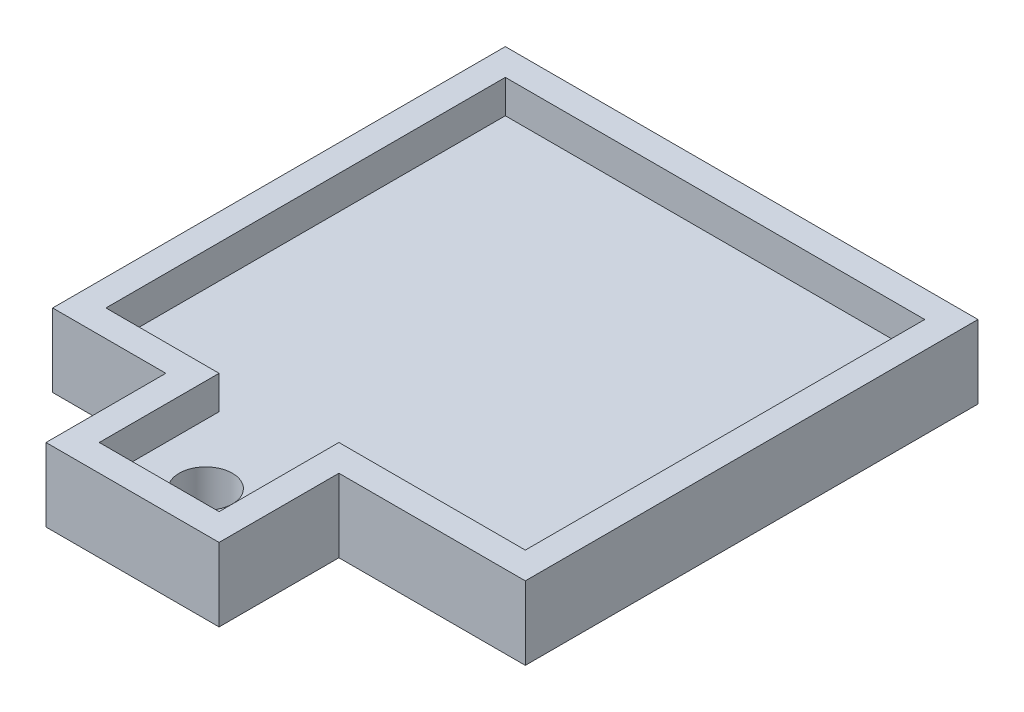
ISO-10303-21;
HEADER;
FILE_DESCRIPTION(('STEP AP214'),'2;1');
FILE_NAME('part.step','',(''),(''),'','','');
FILE_SCHEMA(('AUTOMOTIVE_DESIGN { 1 0 10303 214 1 1 1 1 }'));
ENDSEC;
DATA;
#1=APPLICATION_CONTEXT('core data for automotive mechanical design processes');
#2=APPLICATION_PROTOCOL_DEFINITION('international standard','automotive_design',2000,#1);
#3=PRODUCT_CONTEXT('',#1,'mechanical');
#4=PRODUCT('Part','Part','',(#3));
#5=PRODUCT_RELATED_PRODUCT_CATEGORY('part','',(#4));
#6=PRODUCT_DEFINITION_FORMATION('','',#4);
#7=PRODUCT_DEFINITION_CONTEXT('part definition',#1,'design');
#8=PRODUCT_DEFINITION('design','',#6,#7);
#9=PRODUCT_DEFINITION_SHAPE('','',#8);
#10=(LENGTH_UNIT() NAMED_UNIT(*) SI_UNIT(.MILLI.,.METRE.));
#11=(NAMED_UNIT(*) PLANE_ANGLE_UNIT() SI_UNIT($,.RADIAN.));
#12=(NAMED_UNIT(*) SI_UNIT($,.STERADIAN.) SOLID_ANGLE_UNIT());
#13=UNCERTAINTY_MEASURE_WITH_UNIT(LENGTH_MEASURE(1.E-05),#10,'distance_accuracy_value','');
#14=(GEOMETRIC_REPRESENTATION_CONTEXT(3) GLOBAL_UNCERTAINTY_ASSIGNED_CONTEXT((#13)) GLOBAL_UNIT_ASSIGNED_CONTEXT((#10,
#11,#12)) REPRESENTATION_CONTEXT('',''));
#15=CARTESIAN_POINT('',(0.,0.,0.));
#16=DIRECTION('',(0.,0.,1.));
#17=DIRECTION('',(1.,0.,0.));
#18=AXIS2_PLACEMENT_3D('',#15,#16,#17);
#19=CARTESIAN_POINT('',(-4.42128095830151,16.5,-117.760696826429));
#20=DIRECTION('',(0.,-1.,0.));
#21=DIRECTION('',(0.,0.,-1.));
#22=AXIS2_PLACEMENT_3D('',#19,#20,#21);
#23=CYLINDRICAL_SURFACE('',#22,2.);
#24=CARTESIAN_POINT('',(-4.42128095830151,16.5,-117.760696826429));
#25=DIRECTION('',(0.,1.,0.));
#26=DIRECTION('',(0.,0.,1.));
#27=AXIS2_PLACEMENT_3D('',#24,#25,#26);
#28=CIRCLE('',#27,2.);
#29=CARTESIAN_POINT('',(-4.42128095830151,16.5,-115.760696826429));
#30=VERTEX_POINT('',#29);
#31=EDGE_CURVE('E268',#30,#30,#28,.T.);
#32=ORIENTED_EDGE('',*,*,#31,.T.);
#33=EDGE_LOOP('',(#32));
#34=FACE_BOUND('',#33,.T.);
#35=CARTESIAN_POINT('',(-4.42128095830151,13.5,-117.760696826429));
#36=DIRECTION('',(0.,1.,0.));
#37=DIRECTION('',(0.,0.,1.));
#38=AXIS2_PLACEMENT_3D('',#35,#36,#37);
#39=CIRCLE('',#38,2.);
#40=CARTESIAN_POINT('',(-4.42128095830151,13.5,-115.760696826429));
#41=VERTEX_POINT('',#40);
#42=EDGE_CURVE('E39',#41,#41,#39,.T.);
#43=ORIENTED_EDGE('',*,*,#42,.F.);
#44=EDGE_LOOP('',(#43));
#45=FACE_BOUND('',#44,.T.);
#46=ADVANCED_FACE('F36',(#34,#45),#23,.F.);
#47=CARTESIAN_POINT('',(-1.67128095830151,16.5,-123.260696826429));
#48=DIRECTION('',(0.,1.,0.));
#49=DIRECTION('',(0.,0.,1.));
#50=AXIS2_PLACEMENT_3D('',#47,#48,#49);
#51=PLANE('',#50);
#52=ORIENTED_EDGE('',*,*,#31,.F.);
#53=EDGE_LOOP('',(#52));
#54=FACE_BOUND('',#53,.T.);
#55=DIRECTION('',(0.,0.,-1.));
#56=VECTOR('',#55,1.);
#57=CARTESIAN_POINT('',(0.0787190416984923,16.5,-123.260696826429));
#58=LINE('',#57,#56);
#59=CARTESIAN_POINT('',(0.0787190416984923,16.5,-114.260696826429));
#60=VERTEX_POINT('',#59);
#61=CARTESIAN_POINT('',(0.0787190416984923,16.5,-123.260696826429));
#62=VERTEX_POINT('',#61);
#63=EDGE_CURVE('E271',#60,#62,#58,.T.);
#64=ORIENTED_EDGE('',*,*,#63,.T.);
#65=DIRECTION('',(1.,0.,0.));
#66=VECTOR('',#65,1.);
#67=CARTESIAN_POINT('',(-1.67128095830151,16.5,-123.260696826429));
#68=LINE('',#67,#66);
#69=CARTESIAN_POINT('',(14.0787190416985,16.5,-123.260696826429));
#70=VERTEX_POINT('',#69);
#71=EDGE_CURVE('E273',#62,#70,#68,.T.);
#72=ORIENTED_EDGE('',*,*,#71,.T.);
#73=DIRECTION('',(0.,0.,1.));
#74=VECTOR('',#73,1.);
#75=CARTESIAN_POINT('',(14.0787190416985,16.5,-123.260696826429));
#76=LINE('',#75,#74);
#77=CARTESIAN_POINT('',(14.0787190416985,16.5,-153.260696826429));
#78=VERTEX_POINT('',#77);
#79=EDGE_CURVE('E275',#78,#70,#76,.T.);
#80=ORIENTED_EDGE('',*,*,#79,.F.);
#81=DIRECTION('',(1.,0.,0.));
#82=VECTOR('',#81,1.);
#83=CARTESIAN_POINT('',(-1.67128095830151,16.5,-153.260696826429));
#84=LINE('',#83,#82);
#85=CARTESIAN_POINT('',(-17.4212809583015,16.5,-153.260696826429));
#86=VERTEX_POINT('',#85);
#87=EDGE_CURVE('E152',#86,#78,#84,.T.);
#88=ORIENTED_EDGE('',*,*,#87,.F.);
#89=DIRECTION('',(0.,0.,1.));
#90=VECTOR('',#89,1.);
#91=CARTESIAN_POINT('',(-17.4212809583015,16.5,-123.260696826429));
#92=LINE('',#91,#90);
#93=CARTESIAN_POINT('',(-17.4212809583015,16.5,-123.260696826429));
#94=VERTEX_POINT('',#93);
#95=EDGE_CURVE('E278',#86,#94,#92,.T.);
#96=ORIENTED_EDGE('',*,*,#95,.T.);
#97=DIRECTION('',(1.,0.,0.));
#98=VECTOR('',#97,1.);
#99=CARTESIAN_POINT('',(-1.67128095830151,16.5,-123.260696826429));
#100=LINE('',#99,#98);
#101=CARTESIAN_POINT('',(-8.92128095830151,16.5,-123.260696826429));
#102=VERTEX_POINT('',#101);
#103=EDGE_CURVE('E280',#94,#102,#100,.T.);
#104=ORIENTED_EDGE('',*,*,#103,.T.);
#105=DIRECTION('',(0.,0.,1.));
#106=VECTOR('',#105,1.);
#107=CARTESIAN_POINT('',(-8.92128095830151,16.5,-123.260696826429));
#108=LINE('',#107,#106);
#109=CARTESIAN_POINT('',(-8.92128095830151,16.5,-114.260696826429));
#110=VERTEX_POINT('',#109);
#111=EDGE_CURVE('E44',#102,#110,#108,.T.);
#112=ORIENTED_EDGE('',*,*,#111,.T.);
#113=DIRECTION('',(1.,0.,0.));
#114=VECTOR('',#113,1.);
#115=CARTESIAN_POINT('',(-1.67128095830151,16.5,-114.260696826429));
#116=LINE('',#115,#114);
#117=EDGE_CURVE('E11',#110,#60,#116,.T.);
#118=ORIENTED_EDGE('',*,*,#117,.T.);
#119=EDGE_LOOP('',(#64,#72,#80,#88,#96,#104,#112,#118));
#120=FACE_BOUND('',#119,.T.);
#121=ADVANCED_FACE('F283',(#54,#120),#51,.T.);
#122=CARTESIAN_POINT('',(-1.67128095830151,13.5,-123.260696826429));
#123=DIRECTION('',(0.,1.,0.));
#124=DIRECTION('',(0.,0.,1.));
#125=AXIS2_PLACEMENT_3D('',#122,#123,#124);
#126=PLANE('',#125);
#127=ORIENTED_EDGE('',*,*,#42,.T.);
#128=EDGE_LOOP('',(#127));
#129=FACE_BOUND('',#128,.T.);
#130=DIRECTION('',(-1.,0.,0.));
#131=VECTOR('',#130,1.);
#132=CARTESIAN_POINT('',(-10.9212809583015,13.5,-121.260696826429));
#133=LINE('',#132,#131);
#134=CARTESIAN_POINT('',(-10.9212809583015,13.5,-121.260696826429));
#135=VERTEX_POINT('',#134);
#136=CARTESIAN_POINT('',(-19.4212809583015,13.5,-121.260696826429));
#137=VERTEX_POINT('',#136);
#138=EDGE_CURVE('E188',#135,#137,#133,.T.);
#139=ORIENTED_EDGE('',*,*,#138,.T.);
#140=DIRECTION('',(0.,0.,-1.));
#141=VECTOR('',#140,1.);
#142=CARTESIAN_POINT('',(-19.4212809583015,13.5,-155.260696826429));
#143=LINE('',#142,#141);
#144=CARTESIAN_POINT('',(-19.4212809583015,13.5,-155.260696826429));
#145=VERTEX_POINT('',#144);
#146=EDGE_CURVE('E233',#137,#145,#143,.T.);
#147=ORIENTED_EDGE('',*,*,#146,.T.);
#148=DIRECTION('',(1.,0.,0.));
#149=VECTOR('',#148,1.);
#150=CARTESIAN_POINT('',(16.0787190416985,13.5,-155.260696826429));
#151=LINE('',#150,#149);
#152=CARTESIAN_POINT('',(16.0787190416985,13.5,-155.260696826429));
#153=VERTEX_POINT('',#152);
#154=EDGE_CURVE('E236',#145,#153,#151,.T.);
#155=ORIENTED_EDGE('',*,*,#154,.T.);
#156=DIRECTION('',(0.,0.,1.));
#157=VECTOR('',#156,1.);
#158=CARTESIAN_POINT('',(16.0787190416985,13.5,-155.260696826429));
#159=LINE('',#158,#157);
#160=CARTESIAN_POINT('',(16.0787190416985,13.5,-121.260696826429));
#161=VERTEX_POINT('',#160);
#162=EDGE_CURVE('E239',#153,#161,#159,.T.);
#163=ORIENTED_EDGE('',*,*,#162,.T.);
#164=DIRECTION('',(-1.,0.,0.));
#165=VECTOR('',#164,1.);
#166=CARTESIAN_POINT('',(16.0787190416985,13.5,-121.260696826429));
#167=LINE('',#166,#165);
#168=CARTESIAN_POINT('',(2.07871904169849,13.5,-121.260696826429));
#169=VERTEX_POINT('',#168);
#170=EDGE_CURVE('E242',#161,#169,#167,.T.);
#171=ORIENTED_EDGE('',*,*,#170,.T.);
#172=DIRECTION('',(0.,0.,1.));
#173=VECTOR('',#172,1.);
#174=CARTESIAN_POINT('',(2.07871904169849,13.5,-121.260696826429));
#175=LINE('',#174,#173);
#176=CARTESIAN_POINT('',(2.07871904169849,13.5,-112.260696826429));
#177=VERTEX_POINT('',#176);
#178=EDGE_CURVE('E245',#169,#177,#175,.T.);
#179=ORIENTED_EDGE('',*,*,#178,.T.);
#180=DIRECTION('',(-1.,0.,0.));
#181=VECTOR('',#180,1.);
#182=CARTESIAN_POINT('',(2.07871904169849,13.5,-112.260696826429));
#183=LINE('',#182,#181);
#184=CARTESIAN_POINT('',(-10.9212809583015,13.5,-112.260696826429));
#185=VERTEX_POINT('',#184);
#186=EDGE_CURVE('E248',#177,#185,#183,.T.);
#187=ORIENTED_EDGE('',*,*,#186,.T.);
#188=DIRECTION('',(0.,0.,-1.));
#189=VECTOR('',#188,1.);
#190=CARTESIAN_POINT('',(-10.9212809583015,13.5,-112.260696826429));
#191=LINE('',#190,#189);
#192=EDGE_CURVE('E209',#185,#135,#191,.T.);
#193=ORIENTED_EDGE('',*,*,#192,.T.);
#194=EDGE_LOOP('',(#139,#147,#155,#163,#171,#179,#187,#193));
#195=FACE_BOUND('',#194,.T.);
#196=ADVANCED_FACE('F313',(#129,#195),#126,.F.);
#197=CARTESIAN_POINT('',(-10.9212809583015,19.,-121.260696826429));
#198=DIRECTION('',(0.,0.,1.));
#199=DIRECTION('',(1.,0.,0.));
#200=AXIS2_PLACEMENT_3D('',#197,#198,#199);
#201=PLANE('',#200);
#202=ORIENTED_EDGE('',*,*,#138,.F.);
#203=DIRECTION('',(0.,-1.,0.));
#204=VECTOR('',#203,1.);
#205=CARTESIAN_POINT('',(-10.9212809583015,19.,-121.260696826429));
#206=LINE('',#205,#204);
#207=CARTESIAN_POINT('',(-10.9212809583015,19.,-121.260696826429));
#208=VERTEX_POINT('',#207);
#209=EDGE_CURVE('E253',#208,#135,#206,.T.);
#210=ORIENTED_EDGE('',*,*,#209,.F.);
#211=DIRECTION('',(-1.,0.,0.));
#212=VECTOR('',#211,1.);
#213=CARTESIAN_POINT('',(-10.9212809583015,19.,-121.260696826429));
#214=LINE('',#213,#212);
#215=CARTESIAN_POINT('',(-19.4212809583015,19.,-121.260696826429));
#216=VERTEX_POINT('',#215);
#217=EDGE_CURVE('E205',#208,#216,#214,.T.);
#218=ORIENTED_EDGE('',*,*,#217,.T.);
#219=DIRECTION('',(0.,-1.,0.));
#220=VECTOR('',#219,1.);
#221=CARTESIAN_POINT('',(-19.4212809583015,19.,-121.260696826429));
#222=LINE('',#221,#220);
#223=EDGE_CURVE('E230',#216,#137,#222,.T.);
#224=ORIENTED_EDGE('',*,*,#223,.T.);
#225=EDGE_LOOP('',(#202,#210,#218,#224));
#226=FACE_BOUND('',#225,.T.);
#227=ADVANCED_FACE('F323',(#226),#201,.T.);
#228=CARTESIAN_POINT('',(-10.9212809583015,19.,-112.260696826429));
#229=DIRECTION('',(-1.,0.,0.));
#230=DIRECTION('',(0.,0.,1.));
#231=AXIS2_PLACEMENT_3D('',#228,#229,#230);
#232=PLANE('',#231);
#233=ORIENTED_EDGE('',*,*,#192,.F.);
#234=DIRECTION('',(0.,-1.,0.));
#235=VECTOR('',#234,1.);
#236=CARTESIAN_POINT('',(-10.9212809583015,19.,-112.260696826429));
#237=LINE('',#236,#235);
#238=CARTESIAN_POINT('',(-10.9212809583015,19.,-112.260696826429));
#239=VERTEX_POINT('',#238);
#240=EDGE_CURVE('E255',#239,#185,#237,.T.);
#241=ORIENTED_EDGE('',*,*,#240,.F.);
#242=DIRECTION('',(0.,0.,-1.));
#243=VECTOR('',#242,1.);
#244=CARTESIAN_POINT('',(-10.9212809583015,19.,-112.260696826429));
#245=LINE('',#244,#243);
#246=EDGE_CURVE('E227',#239,#208,#245,.T.);
#247=ORIENTED_EDGE('',*,*,#246,.T.);
#248=ORIENTED_EDGE('',*,*,#209,.T.);
#249=EDGE_LOOP('',(#233,#241,#247,#248));
#250=FACE_BOUND('',#249,.T.);
#251=ADVANCED_FACE('F351',(#250),#232,.T.);
#252=CARTESIAN_POINT('',(2.07871904169849,19.,-112.260696826429));
#253=DIRECTION('',(0.,0.,1.));
#254=DIRECTION('',(1.,0.,0.));
#255=AXIS2_PLACEMENT_3D('',#252,#253,#254);
#256=PLANE('',#255);
#257=ORIENTED_EDGE('',*,*,#186,.F.);
#258=DIRECTION('',(0.,-1.,0.));
#259=VECTOR('',#258,1.);
#260=CARTESIAN_POINT('',(2.07871904169849,19.,-112.260696826429));
#261=LINE('',#260,#259);
#262=CARTESIAN_POINT('',(2.07871904169849,19.,-112.260696826429));
#263=VERTEX_POINT('',#262);
#264=EDGE_CURVE('E257',#263,#177,#261,.T.);
#265=ORIENTED_EDGE('',*,*,#264,.F.);
#266=DIRECTION('',(-1.,0.,0.));
#267=VECTOR('',#266,1.);
#268=CARTESIAN_POINT('',(2.07871904169849,19.,-112.260696826429));
#269=LINE('',#268,#267);
#270=EDGE_CURVE('E224',#263,#239,#269,.T.);
#271=ORIENTED_EDGE('',*,*,#270,.T.);
#272=ORIENTED_EDGE('',*,*,#240,.T.);
#273=EDGE_LOOP('',(#257,#265,#271,#272));
#274=FACE_BOUND('',#273,.T.);
#275=ADVANCED_FACE('F354',(#274),#256,.T.);
#276=CARTESIAN_POINT('',(2.07871904169849,19.,-121.260696826429));
#277=DIRECTION('',(1.,0.,0.));
#278=DIRECTION('',(0.,0.,-1.));
#279=AXIS2_PLACEMENT_3D('',#276,#277,#278);
#280=PLANE('',#279);
#281=ORIENTED_EDGE('',*,*,#178,.F.);
#282=DIRECTION('',(0.,-1.,0.));
#283=VECTOR('',#282,1.);
#284=CARTESIAN_POINT('',(2.07871904169849,19.,-121.260696826429));
#285=LINE('',#284,#283);
#286=CARTESIAN_POINT('',(2.07871904169849,19.,-121.260696826429));
#287=VERTEX_POINT('',#286);
#288=EDGE_CURVE('E259',#287,#169,#285,.T.);
#289=ORIENTED_EDGE('',*,*,#288,.F.);
#290=DIRECTION('',(0.,0.,1.));
#291=VECTOR('',#290,1.);
#292=CARTESIAN_POINT('',(2.07871904169849,19.,-121.260696826429));
#293=LINE('',#292,#291);
#294=EDGE_CURVE('E221',#287,#263,#293,.T.);
#295=ORIENTED_EDGE('',*,*,#294,.T.);
#296=ORIENTED_EDGE('',*,*,#264,.T.);
#297=EDGE_LOOP('',(#281,#289,#295,#296));
#298=FACE_BOUND('',#297,.T.);
#299=ADVANCED_FACE('F347',(#298),#280,.T.);
#300=CARTESIAN_POINT('',(16.0787190416985,19.,-121.260696826429));
#301=DIRECTION('',(0.,0.,1.));
#302=DIRECTION('',(1.,0.,0.));
#303=AXIS2_PLACEMENT_3D('',#300,#301,#302);
#304=PLANE('',#303);
#305=ORIENTED_EDGE('',*,*,#170,.F.);
#306=DIRECTION('',(0.,-1.,0.));
#307=VECTOR('',#306,1.);
#308=CARTESIAN_POINT('',(16.0787190416985,19.,-121.260696826429));
#309=LINE('',#308,#307);
#310=CARTESIAN_POINT('',(16.0787190416985,19.,-121.260696826429));
#311=VERTEX_POINT('',#310);
#312=EDGE_CURVE('E261',#311,#161,#309,.T.);
#313=ORIENTED_EDGE('',*,*,#312,.F.);
#314=DIRECTION('',(-1.,0.,0.));
#315=VECTOR('',#314,1.);
#316=CARTESIAN_POINT('',(16.0787190416985,19.,-121.260696826429));
#317=LINE('',#316,#315);
#318=EDGE_CURVE('E218',#311,#287,#317,.T.);
#319=ORIENTED_EDGE('',*,*,#318,.T.);
#320=ORIENTED_EDGE('',*,*,#288,.T.);
#321=EDGE_LOOP('',(#305,#313,#319,#320));
#322=FACE_BOUND('',#321,.T.);
#323=ADVANCED_FACE('F343',(#322),#304,.T.);
#324=CARTESIAN_POINT('',(16.0787190416985,19.,-155.260696826429));
#325=DIRECTION('',(1.,0.,0.));
#326=DIRECTION('',(0.,0.,-1.));
#327=AXIS2_PLACEMENT_3D('',#324,#325,#326);
#328=PLANE('',#327);
#329=ORIENTED_EDGE('',*,*,#162,.F.);
#330=DIRECTION('',(0.,-1.,0.));
#331=VECTOR('',#330,1.);
#332=CARTESIAN_POINT('',(16.0787190416985,19.,-155.260696826429));
#333=LINE('',#332,#331);
#334=CARTESIAN_POINT('',(16.0787190416985,19.,-155.260696826429));
#335=VERTEX_POINT('',#334);
#336=EDGE_CURVE('E263',#335,#153,#333,.T.);
#337=ORIENTED_EDGE('',*,*,#336,.F.);
#338=DIRECTION('',(0.,0.,1.));
#339=VECTOR('',#338,1.);
#340=CARTESIAN_POINT('',(16.0787190416985,19.,-155.260696826429));
#341=LINE('',#340,#339);
#342=EDGE_CURVE('E215',#335,#311,#341,.T.);
#343=ORIENTED_EDGE('',*,*,#342,.T.);
#344=ORIENTED_EDGE('',*,*,#312,.T.);
#345=EDGE_LOOP('',(#329,#337,#343,#344));
#346=FACE_BOUND('',#345,.T.);
#347=ADVANCED_FACE('F339',(#346),#328,.T.);
#348=CARTESIAN_POINT('',(16.0787190416985,19.,-155.260696826429));
#349=DIRECTION('',(0.,0.,-1.));
#350=DIRECTION('',(-1.,0.,0.));
#351=AXIS2_PLACEMENT_3D('',#348,#349,#350);
#352=PLANE('',#351);
#353=ORIENTED_EDGE('',*,*,#154,.F.);
#354=DIRECTION('',(0.,-1.,0.));
#355=VECTOR('',#354,1.);
#356=CARTESIAN_POINT('',(-19.4212809583015,19.,-155.260696826429));
#357=LINE('',#356,#355);
#358=CARTESIAN_POINT('',(-19.4212809583015,19.,-155.260696826429));
#359=VERTEX_POINT('',#358);
#360=EDGE_CURVE('E265',#359,#145,#357,.T.);
#361=ORIENTED_EDGE('',*,*,#360,.F.);
#362=DIRECTION('',(1.,0.,0.));
#363=VECTOR('',#362,1.);
#364=CARTESIAN_POINT('',(16.0787190416985,19.,-155.260696826429));
#365=LINE('',#364,#363);
#366=EDGE_CURVE('E212',#359,#335,#365,.T.);
#367=ORIENTED_EDGE('',*,*,#366,.T.);
#368=ORIENTED_EDGE('',*,*,#336,.T.);
#369=EDGE_LOOP('',(#353,#361,#367,#368));
#370=FACE_BOUND('',#369,.T.);
#371=ADVANCED_FACE('F335',(#370),#352,.T.);
#372=CARTESIAN_POINT('',(-19.4212809583015,19.,-155.260696826429));
#373=DIRECTION('',(-1.,0.,0.));
#374=DIRECTION('',(0.,0.,1.));
#375=AXIS2_PLACEMENT_3D('',#372,#373,#374);
#376=PLANE('',#375);
#377=ORIENTED_EDGE('',*,*,#146,.F.);
#378=ORIENTED_EDGE('',*,*,#223,.F.);
#379=DIRECTION('',(0.,0.,-1.));
#380=VECTOR('',#379,1.);
#381=CARTESIAN_POINT('',(-19.4212809583015,19.,-155.260696826429));
#382=LINE('',#381,#380);
#383=EDGE_CURVE('E208',#216,#359,#382,.T.);
#384=ORIENTED_EDGE('',*,*,#383,.T.);
#385=ORIENTED_EDGE('',*,*,#360,.T.);
#386=EDGE_LOOP('',(#377,#378,#384,#385));
#387=FACE_BOUND('',#386,.T.);
#388=ADVANCED_FACE('F331',(#387),#376,.T.);
#389=CARTESIAN_POINT('',(0.,19.,0.));
#390=DIRECTION('',(0.,1.,0.));
#391=DIRECTION('',(0.,0.,1.));
#392=AXIS2_PLACEMENT_3D('',#389,#390,#391);
#393=PLANE('',#392);
#394=DIRECTION('',(1.,0.,0.));
#395=VECTOR('',#394,1.);
#396=CARTESIAN_POINT('',(-17.4212809583015,19.,-153.260696826429));
#397=LINE('',#396,#395);
#398=CARTESIAN_POINT('',(-17.4212809583015,19.,-153.260696826429));
#399=VERTEX_POINT('',#398);
#400=CARTESIAN_POINT('',(14.0787190416985,19.,-153.260696826429));
#401=VERTEX_POINT('',#400);
#402=EDGE_CURVE('E150',#399,#401,#397,.T.);
#403=ORIENTED_EDGE('',*,*,#402,.T.);
#404=DIRECTION('',(0.,0.,1.));
#405=VECTOR('',#404,1.);
#406=CARTESIAN_POINT('',(14.0787190416985,19.,-153.260696826429));
#407=LINE('',#406,#405);
#408=CARTESIAN_POINT('',(14.0787190416985,19.,-123.260696826429));
#409=VERTEX_POINT('',#408);
#410=EDGE_CURVE('E160',#401,#409,#407,.T.);
#411=ORIENTED_EDGE('',*,*,#410,.T.);
#412=DIRECTION('',(-1.,0.,0.));
#413=VECTOR('',#412,1.);
#414=CARTESIAN_POINT('',(14.0787190416985,19.,-123.260696826429));
#415=LINE('',#414,#413);
#416=CARTESIAN_POINT('',(0.0787190416984923,19.,-123.260696826429));
#417=VERTEX_POINT('',#416);
#418=EDGE_CURVE('E165',#409,#417,#415,.T.);
#419=ORIENTED_EDGE('',*,*,#418,.T.);
#420=DIRECTION('',(0.,0.,1.));
#421=VECTOR('',#420,1.);
#422=CARTESIAN_POINT('',(0.0787190416984923,19.,-123.260696826429));
#423=LINE('',#422,#421);
#424=CARTESIAN_POINT('',(0.0787190416984923,19.,-114.260696826429));
#425=VERTEX_POINT('',#424);
#426=EDGE_CURVE('E174',#417,#425,#423,.T.);
#427=ORIENTED_EDGE('',*,*,#426,.T.);
#428=DIRECTION('',(-1.,0.,0.));
#429=VECTOR('',#428,1.);
#430=CARTESIAN_POINT('',(0.0787190416984923,19.,-114.260696826429));
#431=LINE('',#430,#429);
#432=CARTESIAN_POINT('',(-8.92128095830151,19.,-114.260696826429));
#433=VERTEX_POINT('',#432);
#434=EDGE_CURVE('E177',#425,#433,#431,.T.);
#435=ORIENTED_EDGE('',*,*,#434,.T.);
#436=DIRECTION('',(0.,0.,-1.));
#437=VECTOR('',#436,1.);
#438=CARTESIAN_POINT('',(-8.92128095830151,19.,-114.260696826429));
#439=LINE('',#438,#437);
#440=CARTESIAN_POINT('',(-8.92128095830151,19.,-123.260696826429));
#441=VERTEX_POINT('',#440);
#442=EDGE_CURVE('E180',#433,#441,#439,.T.);
#443=ORIENTED_EDGE('',*,*,#442,.T.);
#444=DIRECTION('',(-1.,0.,0.));
#445=VECTOR('',#444,1.);
#446=CARTESIAN_POINT('',(-8.92128095830151,19.,-123.260696826429));
#447=LINE('',#446,#445);
#448=CARTESIAN_POINT('',(-17.4212809583015,19.,-123.260696826429));
#449=VERTEX_POINT('',#448);
#450=EDGE_CURVE('E183',#441,#449,#447,.T.);
#451=ORIENTED_EDGE('',*,*,#450,.T.);
#452=DIRECTION('',(0.,0.,-1.));
#453=VECTOR('',#452,1.);
#454=CARTESIAN_POINT('',(-17.4212809583015,19.,-123.260696826429));
#455=LINE('',#454,#453);
#456=EDGE_CURVE('E156',#449,#399,#455,.T.);
#457=ORIENTED_EDGE('',*,*,#456,.T.);
#458=EDGE_LOOP('',(#403,#411,#419,#427,#435,#443,#451,#457));
#459=FACE_BOUND('',#458,.T.);
#460=ORIENTED_EDGE('',*,*,#217,.F.);
#461=ORIENTED_EDGE('',*,*,#246,.F.);
#462=ORIENTED_EDGE('',*,*,#270,.F.);
#463=ORIENTED_EDGE('',*,*,#294,.F.);
#464=ORIENTED_EDGE('',*,*,#318,.F.);
#465=ORIENTED_EDGE('',*,*,#342,.F.);
#466=ORIENTED_EDGE('',*,*,#366,.F.);
#467=ORIENTED_EDGE('',*,*,#383,.F.);
#468=EDGE_LOOP('',(#460,#461,#462,#463,#464,#465,#466,#467));
#469=FACE_BOUND('',#468,.T.);
#470=ADVANCED_FACE('F167',(#459,#469),#393,.T.);
#471=CARTESIAN_POINT('',(-17.4212809583015,19.,-153.260696826429));
#472=DIRECTION('',(0.,0.,-1.));
#473=DIRECTION('',(-1.,0.,0.));
#474=AXIS2_PLACEMENT_3D('',#471,#472,#473);
#475=PLANE('',#474);
#476=ORIENTED_EDGE('',*,*,#87,.T.);
#477=DIRECTION('',(0.,-1.,0.));
#478=VECTOR('',#477,1.);
#479=CARTESIAN_POINT('',(14.0787190416985,19.,-153.260696826429));
#480=LINE('',#479,#478);
#481=EDGE_CURVE('E145',#401,#78,#480,.T.);
#482=ORIENTED_EDGE('',*,*,#481,.F.);
#483=ORIENTED_EDGE('',*,*,#402,.F.);
#484=DIRECTION('',(0.,-1.,0.));
#485=VECTOR('',#484,1.);
#486=CARTESIAN_POINT('',(-17.4212809583015,19.,-153.260696826429));
#487=LINE('',#486,#485);
#488=EDGE_CURVE('E186',#399,#86,#487,.T.);
#489=ORIENTED_EDGE('',*,*,#488,.T.);
#490=EDGE_LOOP('',(#476,#482,#483,#489));
#491=FACE_BOUND('',#490,.T.);
#492=ADVANCED_FACE('F147',(#491),#475,.F.);
#493=CARTESIAN_POINT('',(-17.4212809583015,19.,-123.260696826429));
#494=DIRECTION('',(-1.,0.,0.));
#495=DIRECTION('',(0.,0.,1.));
#496=AXIS2_PLACEMENT_3D('',#493,#494,#495);
#497=PLANE('',#496);
#498=ORIENTED_EDGE('',*,*,#95,.F.);
#499=ORIENTED_EDGE('',*,*,#488,.F.);
#500=ORIENTED_EDGE('',*,*,#456,.F.);
#501=DIRECTION('',(0.,-1.,0.));
#502=VECTOR('',#501,1.);
#503=CARTESIAN_POINT('',(-17.4212809583015,19.,-123.260696826429));
#504=LINE('',#503,#502);
#505=EDGE_CURVE('E189',#449,#94,#504,.T.);
#506=ORIENTED_EDGE('',*,*,#505,.T.);
#507=EDGE_LOOP('',(#498,#499,#500,#506));
#508=FACE_BOUND('',#507,.T.);
#509=ADVANCED_FACE('F432',(#508),#497,.F.);
#510=CARTESIAN_POINT('',(-8.92128095830151,19.,-123.260696826429));
#511=DIRECTION('',(0.,0.,1.));
#512=DIRECTION('',(1.,0.,0.));
#513=AXIS2_PLACEMENT_3D('',#510,#511,#512);
#514=PLANE('',#513);
#515=ORIENTED_EDGE('',*,*,#103,.F.);
#516=ORIENTED_EDGE('',*,*,#505,.F.);
#517=ORIENTED_EDGE('',*,*,#450,.F.);
#518=DIRECTION('',(0.,-1.,0.));
#519=VECTOR('',#518,1.);
#520=CARTESIAN_POINT('',(-8.92128095830151,19.,-123.260696826429));
#521=LINE('',#520,#519);
#522=EDGE_CURVE('E192',#441,#102,#521,.T.);
#523=ORIENTED_EDGE('',*,*,#522,.T.);
#524=EDGE_LOOP('',(#515,#516,#517,#523));
#525=FACE_BOUND('',#524,.T.);
#526=ADVANCED_FACE('F290',(#525),#514,.F.);
#527=CARTESIAN_POINT('',(-8.92128095830151,19.,-114.260696826429));
#528=DIRECTION('',(-1.,0.,0.));
#529=DIRECTION('',(0.,0.,1.));
#530=AXIS2_PLACEMENT_3D('',#527,#528,#529);
#531=PLANE('',#530);
#532=ORIENTED_EDGE('',*,*,#111,.F.);
#533=ORIENTED_EDGE('',*,*,#522,.F.);
#534=ORIENTED_EDGE('',*,*,#442,.F.);
#535=DIRECTION('',(0.,-1.,0.));
#536=VECTOR('',#535,1.);
#537=CARTESIAN_POINT('',(-8.92128095830151,19.,-114.260696826429));
#538=LINE('',#537,#536);
#539=EDGE_CURVE('E195',#433,#110,#538,.T.);
#540=ORIENTED_EDGE('',*,*,#539,.T.);
#541=EDGE_LOOP('',(#532,#533,#534,#540));
#542=FACE_BOUND('',#541,.T.);
#543=ADVANCED_FACE('F287',(#542),#531,.F.);
#544=CARTESIAN_POINT('',(0.0787190416984923,19.,-114.260696826429));
#545=DIRECTION('',(0.,0.,1.));
#546=DIRECTION('',(1.,0.,0.));
#547=AXIS2_PLACEMENT_3D('',#544,#545,#546);
#548=PLANE('',#547);
#549=ORIENTED_EDGE('',*,*,#117,.F.);
#550=ORIENTED_EDGE('',*,*,#539,.F.);
#551=ORIENTED_EDGE('',*,*,#434,.F.);
#552=DIRECTION('',(0.,-1.,0.));
#553=VECTOR('',#552,1.);
#554=CARTESIAN_POINT('',(0.0787190416984923,19.,-114.260696826429));
#555=LINE('',#554,#553);
#556=EDGE_CURVE('E198',#425,#60,#555,.T.);
#557=ORIENTED_EDGE('',*,*,#556,.T.);
#558=EDGE_LOOP('',(#549,#550,#551,#557));
#559=FACE_BOUND('',#558,.T.);
#560=ADVANCED_FACE('F294',(#559),#548,.F.);
#561=CARTESIAN_POINT('',(0.0787190416984923,19.,-123.260696826429));
#562=DIRECTION('',(1.,0.,0.));
#563=DIRECTION('',(0.,0.,-1.));
#564=AXIS2_PLACEMENT_3D('',#561,#562,#563);
#565=PLANE('',#564);
#566=ORIENTED_EDGE('',*,*,#63,.F.);
#567=ORIENTED_EDGE('',*,*,#556,.F.);
#568=ORIENTED_EDGE('',*,*,#426,.F.);
#569=DIRECTION('',(0.,-1.,0.));
#570=VECTOR('',#569,1.);
#571=CARTESIAN_POINT('',(0.0787190416984923,19.,-123.260696826429));
#572=LINE('',#571,#570);
#573=EDGE_CURVE('E201',#417,#62,#572,.T.);
#574=ORIENTED_EDGE('',*,*,#573,.T.);
#575=EDGE_LOOP('',(#566,#567,#568,#574));
#576=FACE_BOUND('',#575,.T.);
#577=ADVANCED_FACE('F296',(#576),#565,.F.);
#578=CARTESIAN_POINT('',(14.0787190416985,19.,-123.260696826429));
#579=DIRECTION('',(0.,0.,1.));
#580=DIRECTION('',(1.,0.,0.));
#581=AXIS2_PLACEMENT_3D('',#578,#579,#580);
#582=PLANE('',#581);
#583=ORIENTED_EDGE('',*,*,#71,.F.);
#584=ORIENTED_EDGE('',*,*,#573,.F.);
#585=ORIENTED_EDGE('',*,*,#418,.F.);
#586=DIRECTION('',(0.,-1.,0.));
#587=VECTOR('',#586,1.);
#588=CARTESIAN_POINT('',(14.0787190416985,19.,-123.260696826429));
#589=LINE('',#588,#587);
#590=EDGE_CURVE('E155',#409,#70,#589,.T.);
#591=ORIENTED_EDGE('',*,*,#590,.T.);
#592=EDGE_LOOP('',(#583,#584,#585,#591));
#593=FACE_BOUND('',#592,.T.);
#594=ADVANCED_FACE('F299',(#593),#582,.F.);
#595=CARTESIAN_POINT('',(14.0787190416985,19.,-153.260696826429));
#596=DIRECTION('',(1.,0.,0.));
#597=DIRECTION('',(0.,0.,-1.));
#598=AXIS2_PLACEMENT_3D('',#595,#596,#597);
#599=PLANE('',#598);
#600=ORIENTED_EDGE('',*,*,#79,.T.);
#601=ORIENTED_EDGE('',*,*,#590,.F.);
#602=ORIENTED_EDGE('',*,*,#410,.F.);
#603=ORIENTED_EDGE('',*,*,#481,.T.);
#604=EDGE_LOOP('',(#600,#601,#602,#603));
#605=FACE_BOUND('',#604,.T.);
#606=ADVANCED_FACE('F161',(#605),#599,.F.);
#607=CLOSED_SHELL('',(#46,#121,#196,#227,#251,#275,#299,#323,#347,#371,#388,#470,#492,#509,#526,
#543,#560,#577,#594,#606));
#608=MANIFOLD_SOLID_BREP('B2',#607);
#609=ADVANCED_BREP_SHAPE_REPRESENTATION('',(#18,#608),#14);
#610=SHAPE_DEFINITION_REPRESENTATION(#9,#609);
ENDSEC;
END-ISO-10303-21;
